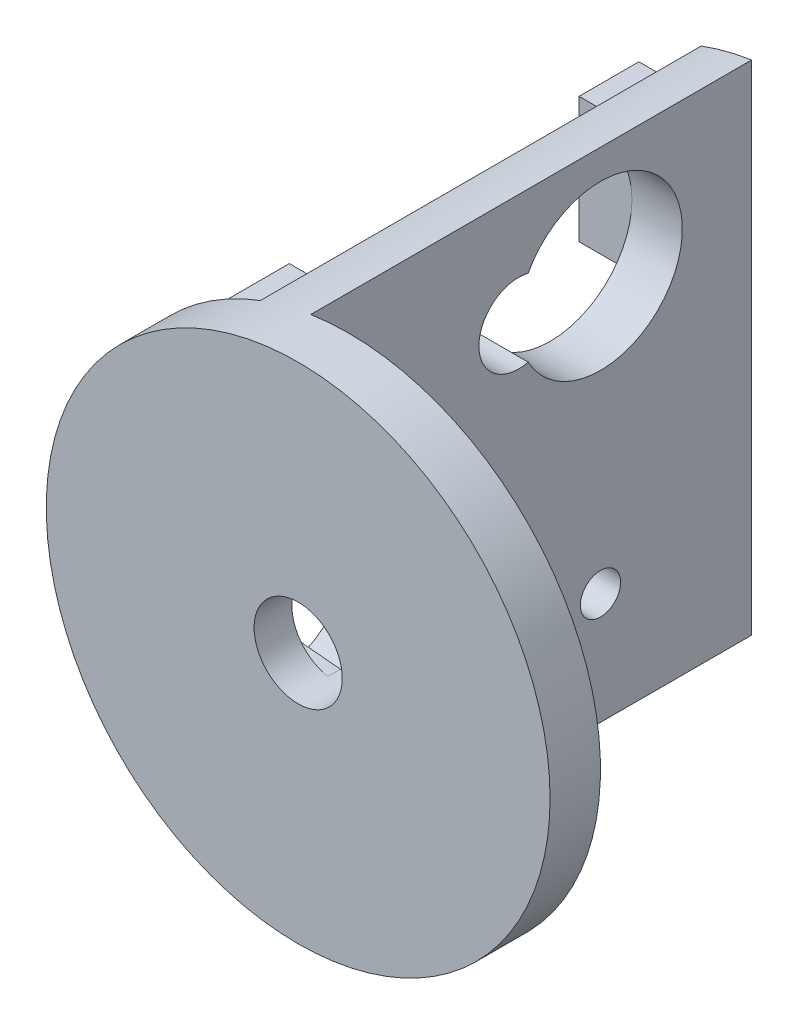
ISO-10303-21;
HEADER;
FILE_DESCRIPTION(('STEP AP214'),'2;1');
FILE_NAME('part.step','',(''),(''),'','','');
FILE_SCHEMA(('AUTOMOTIVE_DESIGN { 1 0 10303 214 1 1 1 1 }'));
ENDSEC;
DATA;
#1=APPLICATION_CONTEXT('core data for automotive mechanical design processes');
#2=APPLICATION_PROTOCOL_DEFINITION('international standard','automotive_design',2000,#1);
#3=PRODUCT_CONTEXT('',#1,'mechanical');
#4=PRODUCT('Part','Part','',(#3));
#5=PRODUCT_RELATED_PRODUCT_CATEGORY('part','',(#4));
#6=PRODUCT_DEFINITION_FORMATION('','',#4);
#7=PRODUCT_DEFINITION_CONTEXT('part definition',#1,'design');
#8=PRODUCT_DEFINITION('design','',#6,#7);
#9=PRODUCT_DEFINITION_SHAPE('','',#8);
#10=(LENGTH_UNIT() NAMED_UNIT(*) SI_UNIT(.MILLI.,.METRE.));
#11=(NAMED_UNIT(*) PLANE_ANGLE_UNIT() SI_UNIT($,.RADIAN.));
#12=(NAMED_UNIT(*) SI_UNIT($,.STERADIAN.) SOLID_ANGLE_UNIT());
#13=UNCERTAINTY_MEASURE_WITH_UNIT(LENGTH_MEASURE(1.E-05),#10,'distance_accuracy_value','');
#14=(GEOMETRIC_REPRESENTATION_CONTEXT(3) GLOBAL_UNCERTAINTY_ASSIGNED_CONTEXT((#13)) GLOBAL_UNIT_ASSIGNED_CONTEXT((#10,
#11,#12)) REPRESENTATION_CONTEXT('',''));
#15=CARTESIAN_POINT('',(0.,0.,0.));
#16=DIRECTION('',(0.,0.,1.));
#17=DIRECTION('',(1.,0.,0.));
#18=AXIS2_PLACEMENT_3D('',#15,#16,#17);
#19=CARTESIAN_POINT('',(0.,0.,0.));
#20=DIRECTION('',(0.,0.,1.));
#21=DIRECTION('',(1.,0.,0.));
#22=AXIS2_PLACEMENT_3D('',#19,#20,#21);
#23=PLANE('',#22);
#24=CARTESIAN_POINT('',(16.,0.,0.));
#25=DIRECTION('',(0.,0.,1.));
#26=DIRECTION('',(1.,0.,0.));
#27=AXIS2_PLACEMENT_3D('',#24,#25,#26);
#28=CIRCLE('',#27,2.);
#29=CARTESIAN_POINT('',(16.,-1.99999999999999,0.));
#30=VERTEX_POINT('',#29);
#31=CARTESIAN_POINT('',(16.,2.,0.));
#32=VERTEX_POINT('',#31);
#33=EDGE_CURVE('E416',#30,#32,#28,.T.);
#34=ORIENTED_EDGE('',*,*,#33,.T.);
#35=DIRECTION('',(0.995634226059288,-0.0933407086930581,0.));
#36=VECTOR('',#35,1.);
#37=CARTESIAN_POINT('',(0.325266214908034,3.46950629235237,0.));
#38=LINE('',#37,#36);
#39=CARTESIAN_POINT('',(0.650532429816068,3.43901258470474,0.));
#40=VERTEX_POINT('',#39);
#41=EDGE_CURVE('E414',#40,#32,#38,.T.);
#42=ORIENTED_EDGE('',*,*,#41,.F.);
#43=CARTESIAN_POINT('',(0.,0.,0.));
#44=DIRECTION('',(0.,0.,1.));
#45=DIRECTION('',(1.,0.,0.));
#46=AXIS2_PLACEMENT_3D('',#43,#44,#45);
#47=CIRCLE('',#46,3.5);
#48=CARTESIAN_POINT('',(-0.650532429816081,3.43901258470474,0.));
#49=VERTEX_POINT('',#48);
#50=EDGE_CURVE('E411',#40,#49,#47,.T.);
#51=ORIENTED_EDGE('',*,*,#50,.T.);
#52=DIRECTION('',(0.995634226059288,0.0933407086930584,0.));
#53=VECTOR('',#52,1.);
#54=CARTESIAN_POINT('',(-0.325266214908035,3.46950629235237,0.));
#55=LINE('',#54,#53);
#56=CARTESIAN_POINT('',(-16.,2.,0.));
#57=VERTEX_POINT('',#56);
#58=EDGE_CURVE('E409',#57,#49,#55,.T.);
#59=ORIENTED_EDGE('',*,*,#58,.F.);
#60=CARTESIAN_POINT('',(-16.,0.,0.));
#61=DIRECTION('',(0.,0.,1.));
#62=DIRECTION('',(1.,0.,0.));
#63=AXIS2_PLACEMENT_3D('',#60,#61,#62);
#64=CIRCLE('',#63,2.);
#65=CARTESIAN_POINT('',(-16.,-2.,0.));
#66=VERTEX_POINT('',#65);
#67=EDGE_CURVE('E406',#57,#66,#64,.T.);
#68=ORIENTED_EDGE('',*,*,#67,.T.);
#69=DIRECTION('',(0.995634226059288,-0.0933407086930582,0.));
#70=VECTOR('',#69,1.);
#71=CARTESIAN_POINT('',(-0.325266214908034,-3.46950629235237,0.));
#72=LINE('',#71,#70);
#73=CARTESIAN_POINT('',(-0.650532429816073,-3.43901258470474,0.));
#74=VERTEX_POINT('',#73);
#75=EDGE_CURVE('E404',#66,#74,#72,.T.);
#76=ORIENTED_EDGE('',*,*,#75,.T.);
#77=CARTESIAN_POINT('',(0.,0.,0.));
#78=DIRECTION('',(0.,0.,1.));
#79=DIRECTION('',(1.,0.,0.));
#80=AXIS2_PLACEMENT_3D('',#77,#78,#79);
#81=CIRCLE('',#80,3.5);
#82=CARTESIAN_POINT('',(0.650532429816078,-3.43901258470474,0.));
#83=VERTEX_POINT('',#82);
#84=EDGE_CURVE('E397',#74,#83,#81,.T.);
#85=ORIENTED_EDGE('',*,*,#84,.T.);
#86=DIRECTION('',(0.995634226059288,0.0933407086930588,0.));
#87=VECTOR('',#86,1.);
#88=CARTESIAN_POINT('',(0.325266214908037,-3.46950629235237,0.));
#89=LINE('',#88,#87);
#90=EDGE_CURVE('E366',#83,#30,#89,.T.);
#91=ORIENTED_EDGE('',*,*,#90,.T.);
#92=EDGE_LOOP('',(#34,#42,#51,#59,#68,#76,#85,#91));
#93=FACE_BOUND('',#92,.T.);
#94=DIRECTION('',(1.,0.,0.));
#95=VECTOR('',#94,1.);
#96=CARTESIAN_POINT('',(-11.2,15.925,0.));
#97=LINE('',#96,#95);
#98=CARTESIAN_POINT('',(-11.2,15.925,0.));
#99=VERTEX_POINT('',#98);
#100=CARTESIAN_POINT('',(-7.,15.925,0.));
#101=VERTEX_POINT('',#100);
#102=EDGE_CURVE('E246',#99,#101,#97,.T.);
#103=ORIENTED_EDGE('',*,*,#102,.F.);
#104=DIRECTION('',(0.,1.,0.));
#105=VECTOR('',#104,1.);
#106=CARTESIAN_POINT('',(-11.2,15.925,0.));
#107=LINE('',#106,#105);
#108=CARTESIAN_POINT('',(-11.2,5.92500000000001,0.));
#109=VERTEX_POINT('',#108);
#110=EDGE_CURVE('E244',#109,#99,#107,.T.);
#111=ORIENTED_EDGE('',*,*,#110,.F.);
#112=DIRECTION('',(1.,0.,0.));
#113=VECTOR('',#112,1.);
#114=CARTESIAN_POINT('',(-11.2,5.92500000000001,0.));
#115=LINE('',#114,#113);
#116=CARTESIAN_POINT('',(-7.,5.925,0.));
#117=VERTEX_POINT('',#116);
#118=EDGE_CURVE('E256',#109,#117,#115,.T.);
#119=ORIENTED_EDGE('',*,*,#118,.T.);
#120=DIRECTION('',(0.,1.,0.));
#121=VECTOR('',#120,1.);
#122=CARTESIAN_POINT('',(-7.,15.925,0.));
#123=LINE('',#122,#121);
#124=CARTESIAN_POINT('',(-7.,8.,0.));
#125=VERTEX_POINT('',#124);
#126=EDGE_CURVE('E240',#117,#125,#123,.T.);
#127=ORIENTED_EDGE('',*,*,#126,.T.);
#128=DIRECTION('',(-1.,0.,0.));
#129=VECTOR('',#128,1.);
#130=CARTESIAN_POINT('',(0.999999999999997,8.,0.));
#131=LINE('',#130,#129);
#132=CARTESIAN_POINT('',(-2.99999999999999,8.,0.));
#133=VERTEX_POINT('',#132);
#134=EDGE_CURVE('E268',#133,#125,#131,.T.);
#135=ORIENTED_EDGE('',*,*,#134,.F.);
#136=DIRECTION('',(0.,1.,0.));
#137=VECTOR('',#136,1.);
#138=CARTESIAN_POINT('',(-2.99999999999999,0.,0.));
#139=LINE('',#138,#137);
#140=CARTESIAN_POINT('',(-2.99999999999999,19.7737199332852,0.));
#141=VERTEX_POINT('',#140);
#142=EDGE_CURVE('E333',#133,#141,#139,.T.);
#143=ORIENTED_EDGE('',*,*,#142,.T.);
#144=CARTESIAN_POINT('',(0.,0.,0.));
#145=DIRECTION('',(0.,0.,1.));
#146=DIRECTION('',(1.,0.,0.));
#147=AXIS2_PLACEMENT_3D('',#144,#145,#146);
#148=CIRCLE('',#147,20.);
#149=CARTESIAN_POINT('',(-3.,-19.7737199332852,0.));
#150=VERTEX_POINT('',#149);
#151=EDGE_CURVE('E361',#150,#141,#148,.T.);
#152=ORIENTED_EDGE('',*,*,#151,.F.);
#153=CARTESIAN_POINT('',(-2.99999999999999,-8.,0.));
#154=VERTEX_POINT('',#153);
#155=EDGE_CURVE('E300',#150,#154,#139,.T.);
#156=ORIENTED_EDGE('',*,*,#155,.T.);
#157=DIRECTION('',(-1.,0.,0.));
#158=VECTOR('',#157,1.);
#159=CARTESIAN_POINT('',(0.999999999999993,-8.,0.));
#160=LINE('',#159,#158);
#161=CARTESIAN_POINT('',(-7.00000000000001,-8.,0.));
#162=VERTEX_POINT('',#161);
#163=EDGE_CURVE('E267',#154,#162,#160,.T.);
#164=ORIENTED_EDGE('',*,*,#163,.T.);
#165=DIRECTION('',(0.,-1.,0.));
#166=VECTOR('',#165,1.);
#167=CARTESIAN_POINT('',(-7.00000000000001,0.,0.));
#168=LINE('',#167,#166);
#169=CARTESIAN_POINT('',(-7.00000000000001,-18.7349939951952,0.));
#170=VERTEX_POINT('',#169);
#171=EDGE_CURVE('E314',#162,#170,#168,.T.);
#172=ORIENTED_EDGE('',*,*,#171,.T.);
#173=CARTESIAN_POINT('',(-7.,18.7349939951952,0.));
#174=VERTEX_POINT('',#173);
#175=EDGE_CURVE('E345',#174,#170,#148,.T.);
#176=ORIENTED_EDGE('',*,*,#175,.F.);
#177=EDGE_CURVE('E295',#174,#101,#168,.T.);
#178=ORIENTED_EDGE('',*,*,#177,.T.);
#179=EDGE_LOOP('',(#103,#111,#119,#127,#135,#143,#152,#156,#164,#172,#176,#178));
#180=FACE_BOUND('',#179,.T.);
#181=ADVANCED_FACE('F34',(#93,#180),#23,.F.);
#182=CARTESIAN_POINT('',(-0.325266214908034,-3.46950629235237,4.));
#183=DIRECTION('',(0.0933407086930582,0.995634226059288,0.));
#184=DIRECTION('',(-0.995634226059288,0.0933407086930581,0.));
#185=AXIS2_PLACEMENT_3D('',#182,#183,#184);
#186=PLANE('',#185);
#187=DIRECTION('',(0.,0.,-1.));
#188=VECTOR('',#187,1.);
#189=CARTESIAN_POINT('',(-16.,-2.,4.));
#190=LINE('',#189,#188);
#191=CARTESIAN_POINT('',(-16.,-2.,1.));
#192=VERTEX_POINT('',#191);
#193=EDGE_CURVE('E434',#192,#66,#190,.T.);
#194=ORIENTED_EDGE('',*,*,#193,.F.);
#195=DIRECTION('',(0.995634226059288,-0.0933407086930581,0.));
#196=VECTOR('',#195,1.);
#197=CARTESIAN_POINT('',(-0.325266214908034,-3.46950629235237,1.));
#198=LINE('',#197,#196);
#199=CARTESIAN_POINT('',(-0.650532429816058,-3.43901258470475,1.));
#200=VERTEX_POINT('',#199);
#201=EDGE_CURVE('E395',#192,#200,#198,.T.);
#202=ORIENTED_EDGE('',*,*,#201,.T.);
#203=DIRECTION('',(0.,0.,-1.));
#204=VECTOR('',#203,1.);
#205=CARTESIAN_POINT('',(-0.650532429816073,-3.43901258470474,4.));
#206=LINE('',#205,#204);
#207=EDGE_CURVE('E334',#200,#74,#206,.T.);
#208=ORIENTED_EDGE('',*,*,#207,.T.);
#209=ORIENTED_EDGE('',*,*,#75,.F.);
#210=EDGE_LOOP('',(#194,#202,#208,#209));
#211=FACE_BOUND('',#210,.T.);
#212=ADVANCED_FACE('F36',(#211),#186,.T.);
#213=CARTESIAN_POINT('',(-16.,0.,4.));
#214=DIRECTION('',(0.,0.,-1.));
#215=DIRECTION('',(-1.,0.,0.));
#216=AXIS2_PLACEMENT_3D('',#213,#214,#215);
#217=CYLINDRICAL_SURFACE('',#216,2.);
#218=DIRECTION('',(0.,0.,-1.));
#219=VECTOR('',#218,1.);
#220=CARTESIAN_POINT('',(-16.,2.,4.));
#221=LINE('',#220,#219);
#222=CARTESIAN_POINT('',(-16.,2.,1.));
#223=VERTEX_POINT('',#222);
#224=EDGE_CURVE('E432',#223,#57,#221,.T.);
#225=ORIENTED_EDGE('',*,*,#224,.F.);
#226=CARTESIAN_POINT('',(-16.,0.,1.));
#227=DIRECTION('',(0.,0.,1.));
#228=DIRECTION('',(1.,0.,0.));
#229=AXIS2_PLACEMENT_3D('',#226,#227,#228);
#230=CIRCLE('',#229,2.);
#231=EDGE_CURVE('E392',#223,#192,#230,.T.);
#232=ORIENTED_EDGE('',*,*,#231,.T.);
#233=ORIENTED_EDGE('',*,*,#193,.T.);
#234=ORIENTED_EDGE('',*,*,#67,.F.);
#235=EDGE_LOOP('',(#225,#232,#233,#234));
#236=FACE_BOUND('',#235,.T.);
#237=ADVANCED_FACE('F466',(#236),#217,.F.);
#238=CARTESIAN_POINT('',(-0.325266214908035,3.46950629235237,4.));
#239=DIRECTION('',(-0.0933407086930584,0.995634226059288,0.));
#240=DIRECTION('',(-0.995634226059288,-0.0933407086930584,0.));
#241=AXIS2_PLACEMENT_3D('',#238,#239,#240);
#242=PLANE('',#241);
#243=DIRECTION('',(0.995634226059288,0.0933407086930584,0.));
#244=VECTOR('',#243,1.);
#245=CARTESIAN_POINT('',(-0.325266214908035,3.46950629235237,1.));
#246=LINE('',#245,#244);
#247=CARTESIAN_POINT('',(-0.650532429816081,3.43901258470474,1.));
#248=VERTEX_POINT('',#247);
#249=EDGE_CURVE('E389',#223,#248,#246,.T.);
#250=ORIENTED_EDGE('',*,*,#249,.F.);
#251=ORIENTED_EDGE('',*,*,#224,.T.);
#252=ORIENTED_EDGE('',*,*,#58,.T.);
#253=DIRECTION('',(0.,0.,-1.));
#254=VECTOR('',#253,1.);
#255=CARTESIAN_POINT('',(-0.650532429816081,3.43901258470474,4.));
#256=LINE('',#255,#254);
#257=EDGE_CURVE('E429',#248,#49,#256,.T.);
#258=ORIENTED_EDGE('',*,*,#257,.F.);
#259=EDGE_LOOP('',(#250,#251,#252,#258));
#260=FACE_BOUND('',#259,.T.);
#261=ADVANCED_FACE('F462',(#260),#242,.F.);
#262=CARTESIAN_POINT('',(0.325266214908034,3.46950629235237,4.));
#263=DIRECTION('',(0.0933407086930581,0.995634226059288,0.));
#264=DIRECTION('',(-0.995634226059288,0.0933407086930581,0.));
#265=AXIS2_PLACEMENT_3D('',#262,#263,#264);
#266=PLANE('',#265);
#267=DIRECTION('',(0.995634226059288,-0.0933407086930581,0.));
#268=VECTOR('',#267,1.);
#269=CARTESIAN_POINT('',(0.325266214908034,3.46950629235237,1.));
#270=LINE('',#269,#268);
#271=CARTESIAN_POINT('',(0.650532429816057,3.43901258470475,1.));
#272=VERTEX_POINT('',#271);
#273=CARTESIAN_POINT('',(16.,2.,1.));
#274=VERTEX_POINT('',#273);
#275=EDGE_CURVE('E387',#272,#274,#270,.T.);
#276=ORIENTED_EDGE('',*,*,#275,.F.);
#277=DIRECTION('',(0.,0.,-1.));
#278=VECTOR('',#277,1.);
#279=CARTESIAN_POINT('',(0.650532429816068,3.43901258470474,4.));
#280=LINE('',#279,#278);
#281=EDGE_CURVE('E427',#272,#40,#280,.T.);
#282=ORIENTED_EDGE('',*,*,#281,.T.);
#283=ORIENTED_EDGE('',*,*,#41,.T.);
#284=DIRECTION('',(0.,0.,-1.));
#285=VECTOR('',#284,1.);
#286=CARTESIAN_POINT('',(16.,2.,4.));
#287=LINE('',#286,#285);
#288=EDGE_CURVE('E424',#274,#32,#287,.T.);
#289=ORIENTED_EDGE('',*,*,#288,.F.);
#290=EDGE_LOOP('',(#276,#282,#283,#289));
#291=FACE_BOUND('',#290,.T.);
#292=ADVANCED_FACE('F495',(#291),#266,.F.);
#293=CARTESIAN_POINT('',(16.,0.,4.));
#294=DIRECTION('',(0.,0.,-1.));
#295=DIRECTION('',(-1.,0.,0.));
#296=AXIS2_PLACEMENT_3D('',#293,#294,#295);
#297=CYLINDRICAL_SURFACE('',#296,2.);
#298=DIRECTION('',(0.,0.,-1.));
#299=VECTOR('',#298,1.);
#300=CARTESIAN_POINT('',(16.,-1.99999999999999,4.));
#301=LINE('',#300,#299);
#302=CARTESIAN_POINT('',(16.,-1.99999999999999,1.));
#303=VERTEX_POINT('',#302);
#304=EDGE_CURVE('E421',#303,#30,#301,.T.);
#305=ORIENTED_EDGE('',*,*,#304,.F.);
#306=CARTESIAN_POINT('',(16.,0.,1.));
#307=DIRECTION('',(0.,0.,1.));
#308=DIRECTION('',(1.,0.,0.));
#309=AXIS2_PLACEMENT_3D('',#306,#307,#308);
#310=CIRCLE('',#309,2.);
#311=EDGE_CURVE('E384',#303,#274,#310,.T.);
#312=ORIENTED_EDGE('',*,*,#311,.T.);
#313=ORIENTED_EDGE('',*,*,#288,.T.);
#314=ORIENTED_EDGE('',*,*,#33,.F.);
#315=EDGE_LOOP('',(#305,#312,#313,#314));
#316=FACE_BOUND('',#315,.T.);
#317=ADVANCED_FACE('F452',(#316),#297,.F.);
#318=CARTESIAN_POINT('',(0.325266214908037,-3.46950629235237,4.));
#319=DIRECTION('',(-0.0933407086930588,0.995634226059288,0.));
#320=DIRECTION('',(-0.995634226059288,-0.0933407086930588,0.));
#321=AXIS2_PLACEMENT_3D('',#318,#319,#320);
#322=PLANE('',#321);
#323=DIRECTION('',(0.,0.,-1.));
#324=VECTOR('',#323,1.);
#325=CARTESIAN_POINT('',(0.650532429816078,-3.43901258470474,4.));
#326=LINE('',#325,#324);
#327=CARTESIAN_POINT('',(0.650532429816078,-3.43901258470474,1.));
#328=VERTEX_POINT('',#327);
#329=EDGE_CURVE('E401',#328,#83,#326,.T.);
#330=ORIENTED_EDGE('',*,*,#329,.F.);
#331=DIRECTION('',(0.995634226059288,0.0933407086930588,0.));
#332=VECTOR('',#331,1.);
#333=CARTESIAN_POINT('',(0.325266214908037,-3.46950629235237,1.));
#334=LINE('',#333,#332);
#335=EDGE_CURVE('E380',#328,#303,#334,.T.);
#336=ORIENTED_EDGE('',*,*,#335,.T.);
#337=ORIENTED_EDGE('',*,*,#304,.T.);
#338=ORIENTED_EDGE('',*,*,#90,.F.);
#339=EDGE_LOOP('',(#330,#336,#337,#338));
#340=FACE_BOUND('',#339,.T.);
#341=ADVANCED_FACE('F448',(#340),#322,.T.);
#342=CARTESIAN_POINT('',(0.,0.,4.));
#343=DIRECTION('',(0.,0.,-1.));
#344=DIRECTION('',(-1.,0.,0.));
#345=AXIS2_PLACEMENT_3D('',#342,#343,#344);
#346=CYLINDRICAL_SURFACE('',#345,3.5);
#347=CARTESIAN_POINT('',(0.,0.,1.));
#348=DIRECTION('',(0.,0.,1.));
#349=DIRECTION('',(1.,0.,0.));
#350=AXIS2_PLACEMENT_3D('',#347,#348,#349);
#351=CIRCLE('',#350,3.5);
#352=EDGE_CURVE('E375',#328,#272,#351,.T.);
#353=ORIENTED_EDGE('',*,*,#352,.F.);
#354=ORIENTED_EDGE('',*,*,#329,.T.);
#355=ORIENTED_EDGE('',*,*,#84,.F.);
#356=ORIENTED_EDGE('',*,*,#207,.F.);
#357=EDGE_CURVE('E376',#248,#200,#351,.T.);
#358=ORIENTED_EDGE('',*,*,#357,.F.);
#359=ORIENTED_EDGE('',*,*,#257,.T.);
#360=ORIENTED_EDGE('',*,*,#50,.F.);
#361=ORIENTED_EDGE('',*,*,#281,.F.);
#362=EDGE_LOOP('',(#353,#354,#355,#356,#358,#359,#360,#361));
#363=FACE_BOUND('',#362,.T.);
#364=CARTESIAN_POINT('',(0.,0.,4.));
#365=DIRECTION('',(0.,0.,1.));
#366=DIRECTION('',(1.,0.,0.));
#367=AXIS2_PLACEMENT_3D('',#364,#365,#366);
#368=CIRCLE('',#367,3.5);
#369=CARTESIAN_POINT('',(3.5,0.,4.));
#370=VERTEX_POINT('',#369);
#371=EDGE_CURVE('E360',#370,#370,#368,.T.);
#372=ORIENTED_EDGE('',*,*,#371,.T.);
#373=EDGE_LOOP('',(#372));
#374=FACE_BOUND('',#373,.T.);
#375=ADVANCED_FACE('F442',(#363,#374),#346,.F.);
#376=CARTESIAN_POINT('',(0.,0.,4.));
#377=DIRECTION('',(0.,0.,-1.));
#378=DIRECTION('',(-1.,0.,0.));
#379=AXIS2_PLACEMENT_3D('',#376,#377,#378);
#380=CYLINDRICAL_SURFACE('',#379,20.);
#381=CARTESIAN_POINT('',(0.,0.,4.));
#382=DIRECTION('',(0.,0.,1.));
#383=DIRECTION('',(1.,0.,0.));
#384=AXIS2_PLACEMENT_3D('',#381,#382,#383);
#385=CIRCLE('',#384,20.);
#386=CARTESIAN_POINT('',(20.,0.,4.));
#387=VERTEX_POINT('',#386);
#388=EDGE_CURVE('E364',#387,#387,#385,.T.);
#389=ORIENTED_EDGE('',*,*,#388,.F.);
#390=EDGE_LOOP('',(#389));
#391=FACE_BOUND('',#390,.T.);
#392=ORIENTED_EDGE('',*,*,#151,.T.);
#393=DIRECTION('',(0.,0.,1.));
#394=VECTOR('',#393,1.);
#395=CARTESIAN_POINT('',(-2.99999999999999,19.7737199332852,-35.));
#396=LINE('',#395,#394);
#397=CARTESIAN_POINT('',(-2.99999999999999,19.7737199332852,-35.));
#398=VERTEX_POINT('',#397);
#399=EDGE_CURVE('E324',#398,#141,#396,.T.);
#400=ORIENTED_EDGE('',*,*,#399,.F.);
#401=CARTESIAN_POINT('',(0.,0.,-35.));
#402=DIRECTION('',(0.,0.,-1.));
#403=DIRECTION('',(-1.,0.,0.));
#404=AXIS2_PLACEMENT_3D('',#401,#402,#403);
#405=CIRCLE('',#404,20.);
#406=CARTESIAN_POINT('',(-7.,18.7349939951952,-35.));
#407=VERTEX_POINT('',#406);
#408=EDGE_CURVE('E299',#407,#398,#405,.T.);
#409=ORIENTED_EDGE('',*,*,#408,.F.);
#410=DIRECTION('',(0.,0.,1.));
#411=VECTOR('',#410,1.);
#412=CARTESIAN_POINT('',(-7.,18.7349939951952,-35.));
#413=LINE('',#412,#411);
#414=EDGE_CURVE('E358',#407,#174,#413,.T.);
#415=ORIENTED_EDGE('',*,*,#414,.T.);
#416=ORIENTED_EDGE('',*,*,#175,.T.);
#417=DIRECTION('',(0.,0.,1.));
#418=VECTOR('',#417,1.);
#419=CARTESIAN_POINT('',(-7.00000000000001,-18.7349939951952,-35.));
#420=LINE('',#419,#418);
#421=CARTESIAN_POINT('',(-7.00000000000001,-18.7349939951952,-35.));
#422=VERTEX_POINT('',#421);
#423=EDGE_CURVE('E307',#422,#170,#420,.T.);
#424=ORIENTED_EDGE('',*,*,#423,.F.);
#425=CARTESIAN_POINT('',(0.,0.,-35.));
#426=DIRECTION('',(0.,0.,-1.));
#427=DIRECTION('',(-1.,0.,0.));
#428=AXIS2_PLACEMENT_3D('',#425,#426,#427);
#429=CIRCLE('',#428,20.);
#430=CARTESIAN_POINT('',(-3.,-19.7737199332852,-35.));
#431=VERTEX_POINT('',#430);
#432=EDGE_CURVE('E305',#431,#422,#429,.T.);
#433=ORIENTED_EDGE('',*,*,#432,.F.);
#434=DIRECTION('',(0.,0.,1.));
#435=VECTOR('',#434,1.);
#436=CARTESIAN_POINT('',(-3.,-19.7737199332852,-35.));
#437=LINE('',#436,#435);
#438=EDGE_CURVE('E322',#431,#150,#437,.T.);
#439=ORIENTED_EDGE('',*,*,#438,.T.);
#440=EDGE_LOOP('',(#392,#400,#409,#415,#416,#424,#433,#439));
#441=FACE_BOUND('',#440,.T.);
#442=ADVANCED_FACE('F356',(#391,#441),#380,.T.);
#443=CARTESIAN_POINT('',(0.,0.,4.));
#444=DIRECTION('',(0.,0.,1.));
#445=DIRECTION('',(1.,0.,0.));
#446=AXIS2_PLACEMENT_3D('',#443,#444,#445);
#447=PLANE('',#446);
#448=ORIENTED_EDGE('',*,*,#371,.F.);
#449=EDGE_LOOP('',(#448));
#450=FACE_BOUND('',#449,.T.);
#451=ORIENTED_EDGE('',*,*,#388,.T.);
#452=EDGE_LOOP('',(#451));
#453=FACE_BOUND('',#452,.T.);
#454=ADVANCED_FACE('F480',(#450,#453),#447,.T.);
#455=CARTESIAN_POINT('',(0.,0.,1.));
#456=DIRECTION('',(0.,0.,1.));
#457=DIRECTION('',(1.,0.,0.));
#458=AXIS2_PLACEMENT_3D('',#455,#456,#457);
#459=PLANE('',#458);
#460=ORIENTED_EDGE('',*,*,#352,.T.);
#461=ORIENTED_EDGE('',*,*,#275,.T.);
#462=ORIENTED_EDGE('',*,*,#311,.F.);
#463=ORIENTED_EDGE('',*,*,#335,.F.);
#464=EDGE_LOOP('',(#460,#461,#462,#463));
#465=FACE_BOUND('',#464,.T.);
#466=ADVANCED_FACE('F470',(#465),#459,.F.);
#467=ORIENTED_EDGE('',*,*,#201,.F.);
#468=ORIENTED_EDGE('',*,*,#231,.F.);
#469=ORIENTED_EDGE('',*,*,#249,.T.);
#470=ORIENTED_EDGE('',*,*,#357,.T.);
#471=EDGE_LOOP('',(#467,#468,#469,#470));
#472=FACE_BOUND('',#471,.T.);
#473=ADVANCED_FACE('F468',(#472),#459,.F.);
#474=CARTESIAN_POINT('',(-7.00000000000001,0.,-35.));
#475=DIRECTION('',(-1.,0.,0.));
#476=DIRECTION('',(0.,-1.,0.));
#477=AXIS2_PLACEMENT_3D('',#474,#475,#476);
#478=PLANE('',#477);
#479=DIRECTION('',(0.,-1.,0.));
#480=VECTOR('',#479,1.);
#481=CARTESIAN_POINT('',(-7.,5.925,-6.5));
#482=LINE('',#481,#480);
#483=CARTESIAN_POINT('',(-7.,15.925,-6.5));
#484=VERTEX_POINT('',#483);
#485=CARTESIAN_POINT('',(-7.,5.925,-6.5));
#486=VERTEX_POINT('',#485);
#487=EDGE_CURVE('E249',#484,#486,#482,.T.);
#488=ORIENTED_EDGE('',*,*,#487,.F.);
#489=DIRECTION('',(0.,0.,-1.));
#490=VECTOR('',#489,1.);
#491=CARTESIAN_POINT('',(-7.,15.925,0.));
#492=LINE('',#491,#490);
#493=EDGE_CURVE('E231',#101,#484,#492,.T.);
#494=ORIENTED_EDGE('',*,*,#493,.F.);
#495=ORIENTED_EDGE('',*,*,#177,.F.);
#496=ORIENTED_EDGE('',*,*,#414,.F.);
#497=DIRECTION('',(0.,-1.,0.));
#498=VECTOR('',#497,1.);
#499=CARTESIAN_POINT('',(-7.00000000000001,0.,-35.));
#500=LINE('',#499,#498);
#501=EDGE_CURVE('E296',#407,#422,#500,.T.);
#502=ORIENTED_EDGE('',*,*,#501,.T.);
#503=ORIENTED_EDGE('',*,*,#423,.T.);
#504=ORIENTED_EDGE('',*,*,#171,.F.);
#505=CARTESIAN_POINT('',(-7.00000000000001,0.,0.));
#506=DIRECTION('',(-1.,0.,0.));
#507=DIRECTION('',(0.,-1.,0.));
#508=AXIS2_PLACEMENT_3D('',#505,#506,#507);
#509=CIRCLE('',#508,8.);
#510=CARTESIAN_POINT('',(-7.,5.925,-5.37534882589028));
#511=VERTEX_POINT('',#510);
#512=EDGE_CURVE('E263',#511,#162,#509,.T.);
#513=ORIENTED_EDGE('',*,*,#512,.F.);
#514=DIRECTION('',(0.,0.,1.));
#515=VECTOR('',#514,1.);
#516=CARTESIAN_POINT('',(-7.,5.925,0.));
#517=LINE('',#516,#515);
#518=EDGE_CURVE('E57',#486,#511,#517,.T.);
#519=ORIENTED_EDGE('',*,*,#518,.F.);
#520=EDGE_LOOP('',(#488,#494,#495,#496,#502,#503,#504,#513,#519));
#521=FACE_BOUND('',#520,.T.);
#522=CARTESIAN_POINT('',(-7.00000000000001,-10.925,-23.));
#523=DIRECTION('',(-1.,0.,0.));
#524=DIRECTION('',(0.,-1.,0.));
#525=AXIS2_PLACEMENT_3D('',#522,#523,#524);
#526=CIRCLE('',#525,1.6);
#527=CARTESIAN_POINT('',(-7.00000000000001,-12.525,-23.));
#528=VERTEX_POINT('',#527);
#529=EDGE_CURVE('E276',#528,#528,#526,.T.);
#530=ORIENTED_EDGE('',*,*,#529,.F.);
#531=EDGE_LOOP('',(#530));
#532=FACE_BOUND('',#531,.T.);
#533=DIRECTION('',(0.,0.,-1.));
#534=VECTOR('',#533,1.);
#535=CARTESIAN_POINT('',(-7.,15.925,-34.25));
#536=LINE('',#535,#534);
#537=CARTESIAN_POINT('',(-7.,15.925,-29.5));
#538=VERTEX_POINT('',#537);
#539=CARTESIAN_POINT('',(-7.,15.925,-34.25));
#540=VERTEX_POINT('',#539);
#541=EDGE_CURVE('E778',#538,#540,#536,.T.);
#542=ORIENTED_EDGE('',*,*,#541,.F.);
#543=DIRECTION('',(0.,1.,0.));
#544=VECTOR('',#543,1.);
#545=CARTESIAN_POINT('',(-7.,15.925,-29.5));
#546=LINE('',#545,#544);
#547=CARTESIAN_POINT('',(-7.,10.925,-29.5));
#548=VERTEX_POINT('',#547);
#549=EDGE_CURVE('E227',#548,#538,#546,.T.);
#550=ORIENTED_EDGE('',*,*,#549,.F.);
#551=CARTESIAN_POINT('',(-7.,10.925,-23.));
#552=DIRECTION('',(-1.,0.,0.));
#553=DIRECTION('',(0.,-1.,0.));
#554=AXIS2_PLACEMENT_3D('',#551,#552,#553);
#555=CIRCLE('',#554,6.5);
#556=CARTESIAN_POINT('',(-7.,13.9811282828705,-17.2632692307692));
#557=VERTEX_POINT('',#556);
#558=EDGE_CURVE('E292',#557,#548,#555,.T.);
#559=ORIENTED_EDGE('',*,*,#558,.F.);
#560=CARTESIAN_POINT('',(-7.,10.925,-16.5));
#561=DIRECTION('',(-1.,0.,0.));
#562=DIRECTION('',(0.,-1.,0.));
#563=AXIS2_PLACEMENT_3D('',#560,#561,#562);
#564=CIRCLE('',#563,3.15);
#565=CARTESIAN_POINT('',(-7.,7.8688717171295,-17.2632692307692));
#566=VERTEX_POINT('',#565);
#567=EDGE_CURVE('E287',#566,#557,#564,.T.);
#568=ORIENTED_EDGE('',*,*,#567,.F.);
#569=EDGE_CURVE('E291',#548,#566,#555,.T.);
#570=ORIENTED_EDGE('',*,*,#569,.F.);
#571=CARTESIAN_POINT('',(-7.,5.92499999999999,-29.5));
#572=VERTEX_POINT('',#571);
#573=EDGE_CURVE('E772',#572,#548,#546,.T.);
#574=ORIENTED_EDGE('',*,*,#573,.F.);
#575=DIRECTION('',(0.,0.,1.));
#576=VECTOR('',#575,1.);
#577=CARTESIAN_POINT('',(-7.,5.92499999999999,-34.25));
#578=LINE('',#577,#576);
#579=CARTESIAN_POINT('',(-7.,5.92499999999999,-34.25));
#580=VERTEX_POINT('',#579);
#581=EDGE_CURVE('E223',#580,#572,#578,.T.);
#582=ORIENTED_EDGE('',*,*,#581,.F.);
#583=DIRECTION('',(0.,-1.,0.));
#584=VECTOR('',#583,1.);
#585=CARTESIAN_POINT('',(-7.,15.925,-34.25));
#586=LINE('',#585,#584);
#587=EDGE_CURVE('E780',#540,#580,#586,.T.);
#588=ORIENTED_EDGE('',*,*,#587,.F.);
#589=EDGE_LOOP('',(#542,#550,#559,#568,#570,#574,#582,#588));
#590=FACE_BOUND('',#589,.T.);
#591=ADVANCED_FACE('F350',(#521,#532,#590),#478,.T.);
#592=CARTESIAN_POINT('',(-2.99999999999999,0.,-35.));
#593=DIRECTION('',(1.,0.,0.));
#594=DIRECTION('',(0.,1.,0.));
#595=AXIS2_PLACEMENT_3D('',#592,#593,#594);
#596=PLANE('',#595);
#597=CARTESIAN_POINT('',(-2.99999999999999,0.,0.));
#598=DIRECTION('',(1.,0.,0.));
#599=DIRECTION('',(0.,1.,0.));
#600=AXIS2_PLACEMENT_3D('',#597,#598,#599);
#601=CIRCLE('',#600,8.);
#602=EDGE_CURVE('E335',#154,#133,#601,.T.);
#603=ORIENTED_EDGE('',*,*,#602,.F.);
#604=ORIENTED_EDGE('',*,*,#155,.F.);
#605=ORIENTED_EDGE('',*,*,#438,.F.);
#606=DIRECTION('',(0.,1.,0.));
#607=VECTOR('',#606,1.);
#608=CARTESIAN_POINT('',(-2.99999999999999,0.,-35.));
#609=LINE('',#608,#607);
#610=EDGE_CURVE('E302',#431,#398,#609,.T.);
#611=ORIENTED_EDGE('',*,*,#610,.T.);
#612=ORIENTED_EDGE('',*,*,#399,.T.);
#613=ORIENTED_EDGE('',*,*,#142,.F.);
#614=EDGE_LOOP('',(#603,#604,#605,#611,#612,#613));
#615=FACE_BOUND('',#614,.T.);
#616=CARTESIAN_POINT('',(-3.,-10.925,-23.));
#617=DIRECTION('',(1.,0.,0.));
#618=DIRECTION('',(0.,1.,0.));
#619=AXIS2_PLACEMENT_3D('',#616,#617,#618);
#620=CIRCLE('',#619,1.6);
#621=CARTESIAN_POINT('',(-3.,-9.325,-23.));
#622=VERTEX_POINT('',#621);
#623=EDGE_CURVE('E271',#622,#622,#620,.T.);
#624=ORIENTED_EDGE('',*,*,#623,.F.);
#625=EDGE_LOOP('',(#624));
#626=FACE_BOUND('',#625,.T.);
#627=CARTESIAN_POINT('',(-2.99999999999999,10.925,-23.));
#628=DIRECTION('',(1.,0.,0.));
#629=DIRECTION('',(0.,1.,0.));
#630=AXIS2_PLACEMENT_3D('',#627,#628,#629);
#631=CIRCLE('',#630,6.5);
#632=CARTESIAN_POINT('',(-2.99999999999999,7.86887171712951,-17.2632692307692));
#633=VERTEX_POINT('',#632);
#634=CARTESIAN_POINT('',(-2.99999999999999,13.9811282828705,-17.2632692307692));
#635=VERTEX_POINT('',#634);
#636=EDGE_CURVE('E279',#633,#635,#631,.T.);
#637=ORIENTED_EDGE('',*,*,#636,.F.);
#638=CARTESIAN_POINT('',(-2.99999999999999,10.925,-16.5));
#639=DIRECTION('',(1.,0.,0.));
#640=DIRECTION('',(0.,1.,0.));
#641=AXIS2_PLACEMENT_3D('',#638,#639,#640);
#642=CIRCLE('',#641,3.15);
#643=EDGE_CURVE('E281',#635,#633,#642,.T.);
#644=ORIENTED_EDGE('',*,*,#643,.F.);
#645=EDGE_LOOP('',(#637,#644));
#646=FACE_BOUND('',#645,.T.);
#647=ADVANCED_FACE('F476',(#615,#626,#646),#596,.T.);
#648=CARTESIAN_POINT('',(0.,0.,-35.));
#649=DIRECTION('',(0.,0.,-1.));
#650=DIRECTION('',(-1.,0.,0.));
#651=AXIS2_PLACEMENT_3D('',#648,#649,#650);
#652=PLANE('',#651);
#653=ORIENTED_EDGE('',*,*,#501,.F.);
#654=ORIENTED_EDGE('',*,*,#408,.T.);
#655=ORIENTED_EDGE('',*,*,#610,.F.);
#656=ORIENTED_EDGE('',*,*,#432,.T.);
#657=EDGE_LOOP('',(#653,#654,#655,#656));
#658=FACE_BOUND('',#657,.T.);
#659=ADVANCED_FACE('F571',(#658),#652,.T.);
#660=CARTESIAN_POINT('',(-13.,10.925,-23.));
#661=DIRECTION('',(1.,0.,0.));
#662=DIRECTION('',(0.,1.,0.));
#663=AXIS2_PLACEMENT_3D('',#660,#661,#662);
#664=CYLINDRICAL_SURFACE('',#663,6.5);
#665=ORIENTED_EDGE('',*,*,#558,.T.);
#666=ORIENTED_EDGE('',*,*,#569,.T.);
#667=DIRECTION('',(1.,0.,0.));
#668=VECTOR('',#667,1.);
#669=CARTESIAN_POINT('',(-13.,7.86887171712951,-17.2632692307692));
#670=LINE('',#669,#668);
#671=EDGE_CURVE('E285',#566,#633,#670,.T.);
#672=ORIENTED_EDGE('',*,*,#671,.T.);
#673=ORIENTED_EDGE('',*,*,#636,.T.);
#674=DIRECTION('',(1.,0.,0.));
#675=VECTOR('',#674,1.);
#676=CARTESIAN_POINT('',(-13.,13.9811282828705,-17.2632692307692));
#677=LINE('',#676,#675);
#678=EDGE_CURVE('E284',#557,#635,#677,.T.);
#679=ORIENTED_EDGE('',*,*,#678,.F.);
#680=EDGE_LOOP('',(#665,#666,#672,#673,#679));
#681=FACE_BOUND('',#680,.T.);
#682=ADVANCED_FACE('F582',(#681),#664,.F.);
#683=CARTESIAN_POINT('',(-13.,10.925,-16.5));
#684=DIRECTION('',(1.,0.,0.));
#685=DIRECTION('',(0.,1.,0.));
#686=AXIS2_PLACEMENT_3D('',#683,#684,#685);
#687=CYLINDRICAL_SURFACE('',#686,3.15);
#688=ORIENTED_EDGE('',*,*,#567,.T.);
#689=ORIENTED_EDGE('',*,*,#678,.T.);
#690=ORIENTED_EDGE('',*,*,#643,.T.);
#691=ORIENTED_EDGE('',*,*,#671,.F.);
#692=EDGE_LOOP('',(#688,#689,#690,#691));
#693=FACE_BOUND('',#692,.T.);
#694=ADVANCED_FACE('F597',(#693),#687,.F.);
#695=CARTESIAN_POINT('',(-13.,-10.925,-23.));
#696=DIRECTION('',(1.,0.,0.));
#697=DIRECTION('',(0.,1.,0.));
#698=AXIS2_PLACEMENT_3D('',#695,#696,#697);
#699=CYLINDRICAL_SURFACE('',#698,1.6);
#700=ORIENTED_EDGE('',*,*,#529,.T.);
#701=EDGE_LOOP('',(#700));
#702=FACE_BOUND('',#701,.T.);
#703=ORIENTED_EDGE('',*,*,#623,.T.);
#704=EDGE_LOOP('',(#703));
#705=FACE_BOUND('',#704,.T.);
#706=ADVANCED_FACE('F606',(#702,#705),#699,.F.);
#707=CARTESIAN_POINT('',(0.999999999999995,0.,0.));
#708=DIRECTION('',(-1.,0.,0.));
#709=DIRECTION('',(0.,-1.,0.));
#710=AXIS2_PLACEMENT_3D('',#707,#708,#709);
#711=CYLINDRICAL_SURFACE('',#710,8.);
#712=ORIENTED_EDGE('',*,*,#602,.T.);
#713=ORIENTED_EDGE('',*,*,#134,.T.);
#714=EDGE_CURVE('E264',#125,#511,#509,.T.);
#715=ORIENTED_EDGE('',*,*,#714,.T.);
#716=ORIENTED_EDGE('',*,*,#512,.T.);
#717=ORIENTED_EDGE('',*,*,#163,.F.);
#718=EDGE_LOOP('',(#712,#713,#715,#716,#717));
#719=FACE_BOUND('',#718,.T.);
#720=ADVANCED_FACE('F615',(#719),#711,.F.);
#721=CARTESIAN_POINT('',(-7.00000000000001,0.,0.));
#722=DIRECTION('',(1.,0.,0.));
#723=DIRECTION('',(0.,1.,0.));
#724=AXIS2_PLACEMENT_3D('',#721,#722,#723);
#725=PLANE('',#724);
#726=ORIENTED_EDGE('',*,*,#714,.F.);
#727=ORIENTED_EDGE('',*,*,#126,.F.);
#728=EDGE_CURVE('E251',#511,#117,#517,.T.);
#729=ORIENTED_EDGE('',*,*,#728,.F.);
#730=EDGE_LOOP('',(#726,#727,#729));
#731=FACE_BOUND('',#730,.T.);
#732=ADVANCED_FACE('F623',(#731),#725,.T.);
#733=CARTESIAN_POINT('',(-11.2,0.,0.));
#734=DIRECTION('',(1.,0.,0.));
#735=DIRECTION('',(0.,1.,0.));
#736=AXIS2_PLACEMENT_3D('',#733,#734,#735);
#737=PLANE('',#736);
#738=DIRECTION('',(0.,0.,-1.));
#739=VECTOR('',#738,1.);
#740=CARTESIAN_POINT('',(-11.2,15.925,0.));
#741=LINE('',#740,#739);
#742=CARTESIAN_POINT('',(-11.2,15.925,-6.5));
#743=VERTEX_POINT('',#742);
#744=EDGE_CURVE('E236',#99,#743,#741,.T.);
#745=ORIENTED_EDGE('',*,*,#744,.T.);
#746=DIRECTION('',(0.,-1.,0.));
#747=VECTOR('',#746,1.);
#748=CARTESIAN_POINT('',(-11.2,5.925,-6.5));
#749=LINE('',#748,#747);
#750=CARTESIAN_POINT('',(-11.2,5.925,-6.5));
#751=VERTEX_POINT('',#750);
#752=EDGE_CURVE('E239',#743,#751,#749,.T.);
#753=ORIENTED_EDGE('',*,*,#752,.T.);
#754=DIRECTION('',(0.,0.,1.));
#755=VECTOR('',#754,1.);
#756=CARTESIAN_POINT('',(-11.2,5.92500000000001,0.));
#757=LINE('',#756,#755);
#758=EDGE_CURVE('E242',#751,#109,#757,.T.);
#759=ORIENTED_EDGE('',*,*,#758,.T.);
#760=ORIENTED_EDGE('',*,*,#110,.T.);
#761=EDGE_LOOP('',(#745,#753,#759,#760));
#762=FACE_BOUND('',#761,.T.);
#763=CARTESIAN_POINT('',(-11.2,10.925,-4.25));
#764=DIRECTION('',(-1.,0.,0.));
#765=DIRECTION('',(0.,-1.,0.));
#766=AXIS2_PLACEMENT_3D('',#763,#764,#765);
#767=CIRCLE('',#766,0.75);
#768=CARTESIAN_POINT('',(-11.2,10.175,-4.25));
#769=VERTEX_POINT('',#768);
#770=EDGE_CURVE('E228',#769,#769,#767,.T.);
#771=ORIENTED_EDGE('',*,*,#770,.F.);
#772=EDGE_LOOP('',(#771));
#773=FACE_BOUND('',#772,.T.);
#774=ADVANCED_FACE('F657',(#762,#773),#737,.F.);
#775=CARTESIAN_POINT('',(-11.2,15.925,0.));
#776=DIRECTION('',(0.,-1.,0.));
#777=DIRECTION('',(1.,0.,0.));
#778=AXIS2_PLACEMENT_3D('',#775,#776,#777);
#779=PLANE('',#778);
#780=ORIENTED_EDGE('',*,*,#493,.T.);
#781=DIRECTION('',(1.,0.,0.));
#782=VECTOR('',#781,1.);
#783=CARTESIAN_POINT('',(-11.2,15.925,-6.5));
#784=LINE('',#783,#782);
#785=EDGE_CURVE('E261',#743,#484,#784,.T.);
#786=ORIENTED_EDGE('',*,*,#785,.F.);
#787=ORIENTED_EDGE('',*,*,#744,.F.);
#788=ORIENTED_EDGE('',*,*,#102,.T.);
#789=EDGE_LOOP('',(#780,#786,#787,#788));
#790=FACE_BOUND('',#789,.T.);
#791=ADVANCED_FACE('F666',(#790),#779,.F.);
#792=CARTESIAN_POINT('',(-11.2,5.925,-6.5));
#793=DIRECTION('',(0.,0.,1.));
#794=DIRECTION('',(1.,0.,0.));
#795=AXIS2_PLACEMENT_3D('',#792,#793,#794);
#796=PLANE('',#795);
#797=ORIENTED_EDGE('',*,*,#487,.T.);
#798=DIRECTION('',(1.,0.,0.));
#799=VECTOR('',#798,1.);
#800=CARTESIAN_POINT('',(-11.2,5.925,-6.5));
#801=LINE('',#800,#799);
#802=EDGE_CURVE('E259',#751,#486,#801,.T.);
#803=ORIENTED_EDGE('',*,*,#802,.F.);
#804=ORIENTED_EDGE('',*,*,#752,.F.);
#805=ORIENTED_EDGE('',*,*,#785,.T.);
#806=EDGE_LOOP('',(#797,#803,#804,#805));
#807=FACE_BOUND('',#806,.T.);
#808=ADVANCED_FACE('F675',(#807),#796,.F.);
#809=CARTESIAN_POINT('',(-11.2,5.92500000000001,0.));
#810=DIRECTION('',(0.,1.,0.));
#811=DIRECTION('',(-1.,0.,0.));
#812=AXIS2_PLACEMENT_3D('',#809,#810,#811);
#813=PLANE('',#812);
#814=ORIENTED_EDGE('',*,*,#518,.T.);
#815=ORIENTED_EDGE('',*,*,#728,.T.);
#816=ORIENTED_EDGE('',*,*,#118,.F.);
#817=ORIENTED_EDGE('',*,*,#758,.F.);
#818=ORIENTED_EDGE('',*,*,#802,.T.);
#819=EDGE_LOOP('',(#814,#815,#816,#817,#818));
#820=FACE_BOUND('',#819,.T.);
#821=ADVANCED_FACE('F684',(#820),#813,.F.);
#822=CARTESIAN_POINT('',(-11.2,10.925,-4.25));
#823=DIRECTION('',(1.,0.,0.));
#824=DIRECTION('',(0.,1.,0.));
#825=AXIS2_PLACEMENT_3D('',#822,#823,#824);
#826=CYLINDRICAL_SURFACE('',#825,0.75);
#827=ORIENTED_EDGE('',*,*,#770,.T.);
#828=EDGE_LOOP('',(#827));
#829=FACE_BOUND('',#828,.T.);
#830=CARTESIAN_POINT('',(-7.,10.925,-4.25));
#831=DIRECTION('',(-1.,0.,0.));
#832=DIRECTION('',(0.,-1.,0.));
#833=AXIS2_PLACEMENT_3D('',#830,#831,#832);
#834=CIRCLE('',#833,0.75);
#835=CARTESIAN_POINT('',(-7.,10.175,-4.25));
#836=VERTEX_POINT('',#835);
#837=EDGE_CURVE('E42',#836,#836,#834,.F.);
#838=ORIENTED_EDGE('',*,*,#837,.T.);
#839=EDGE_LOOP('',(#838));
#840=FACE_BOUND('',#839,.T.);
#841=ADVANCED_FACE('F632',(#829,#840),#826,.F.);
#842=ORIENTED_EDGE('',*,*,#837,.F.);
#843=EDGE_LOOP('',(#842));
#844=FACE_BOUND('',#843,.T.);
#845=ADVANCED_FACE('F479',(#844),#478,.T.);
#846=CARTESIAN_POINT('',(-11.2,0.,0.));
#847=DIRECTION('',(-1.,0.,0.));
#848=DIRECTION('',(0.,-1.,0.));
#849=AXIS2_PLACEMENT_3D('',#846,#847,#848);
#850=PLANE('',#849);
#851=DIRECTION('',(0.,1.,0.));
#852=VECTOR('',#851,1.);
#853=CARTESIAN_POINT('',(-11.2,15.925,-29.5));
#854=LINE('',#853,#852);
#855=CARTESIAN_POINT('',(-11.2,5.92499999999999,-29.5));
#856=VERTEX_POINT('',#855);
#857=CARTESIAN_POINT('',(-11.2,15.925,-29.5));
#858=VERTEX_POINT('',#857);
#859=EDGE_CURVE('E214',#856,#858,#854,.T.);
#860=ORIENTED_EDGE('',*,*,#859,.T.);
#861=DIRECTION('',(0.,0.,-1.));
#862=VECTOR('',#861,1.);
#863=CARTESIAN_POINT('',(-11.2,15.925,-34.25));
#864=LINE('',#863,#862);
#865=CARTESIAN_POINT('',(-11.2,15.925,-34.25));
#866=VERTEX_POINT('',#865);
#867=EDGE_CURVE('E203',#858,#866,#864,.T.);
#868=ORIENTED_EDGE('',*,*,#867,.T.);
#869=DIRECTION('',(0.,-1.,0.));
#870=VECTOR('',#869,1.);
#871=CARTESIAN_POINT('',(-11.2,15.925,-34.25));
#872=LINE('',#871,#870);
#873=CARTESIAN_POINT('',(-11.2,5.92499999999999,-34.25));
#874=VERTEX_POINT('',#873);
#875=EDGE_CURVE('E213',#866,#874,#872,.T.);
#876=ORIENTED_EDGE('',*,*,#875,.T.);
#877=DIRECTION('',(0.,0.,1.));
#878=VECTOR('',#877,1.);
#879=CARTESIAN_POINT('',(-11.2,5.92499999999999,-34.25));
#880=LINE('',#879,#878);
#881=EDGE_CURVE('E219',#874,#856,#880,.T.);
#882=ORIENTED_EDGE('',*,*,#881,.T.);
#883=EDGE_LOOP('',(#860,#868,#876,#882));
#884=FACE_BOUND('',#883,.T.);
#885=CARTESIAN_POINT('',(-11.2,10.925,-31.875));
#886=DIRECTION('',(-1.,0.,0.));
#887=DIRECTION('',(0.,-1.,0.));
#888=AXIS2_PLACEMENT_3D('',#885,#886,#887);
#889=CIRCLE('',#888,0.750000000000002);
#890=CARTESIAN_POINT('',(-11.2,10.175,-31.875));
#891=VERTEX_POINT('',#890);
#892=EDGE_CURVE('E769',#891,#891,#889,.T.);
#893=ORIENTED_EDGE('',*,*,#892,.F.);
#894=EDGE_LOOP('',(#893));
#895=FACE_BOUND('',#894,.T.);
#896=ADVANCED_FACE('F217',(#884,#895),#850,.T.);
#897=CARTESIAN_POINT('',(-11.2,15.925,-29.5));
#898=DIRECTION('',(0.,0.,-1.));
#899=DIRECTION('',(0.,1.,0.));
#900=AXIS2_PLACEMENT_3D('',#897,#898,#899);
#901=PLANE('',#900);
#902=ORIENTED_EDGE('',*,*,#573,.T.);
#903=ORIENTED_EDGE('',*,*,#549,.T.);
#904=DIRECTION('',(1.,0.,0.));
#905=VECTOR('',#904,1.);
#906=CARTESIAN_POINT('',(-11.2,15.925,-29.5));
#907=LINE('',#906,#905);
#908=EDGE_CURVE('E207',#858,#538,#907,.T.);
#909=ORIENTED_EDGE('',*,*,#908,.F.);
#910=ORIENTED_EDGE('',*,*,#859,.F.);
#911=DIRECTION('',(1.,0.,0.));
#912=VECTOR('',#911,1.);
#913=CARTESIAN_POINT('',(-11.2,5.92499999999999,-29.5));
#914=LINE('',#913,#912);
#915=EDGE_CURVE('E776',#856,#572,#914,.T.);
#916=ORIENTED_EDGE('',*,*,#915,.T.);
#917=EDGE_LOOP('',(#902,#903,#909,#910,#916));
#918=FACE_BOUND('',#917,.T.);
#919=ADVANCED_FACE('F225',(#918),#901,.F.);
#920=CARTESIAN_POINT('',(-11.2,15.925,-34.25));
#921=DIRECTION('',(0.,-1.,0.));
#922=DIRECTION('',(1.,0.,0.));
#923=AXIS2_PLACEMENT_3D('',#920,#921,#922);
#924=PLANE('',#923);
#925=ORIENTED_EDGE('',*,*,#541,.T.);
#926=DIRECTION('',(1.,0.,0.));
#927=VECTOR('',#926,1.);
#928=CARTESIAN_POINT('',(-11.2,15.925,-34.25));
#929=LINE('',#928,#927);
#930=EDGE_CURVE('E210',#866,#540,#929,.T.);
#931=ORIENTED_EDGE('',*,*,#930,.F.);
#932=ORIENTED_EDGE('',*,*,#867,.F.);
#933=ORIENTED_EDGE('',*,*,#908,.T.);
#934=EDGE_LOOP('',(#925,#931,#932,#933));
#935=FACE_BOUND('',#934,.T.);
#936=ADVANCED_FACE('F205',(#935),#924,.F.);
#937=CARTESIAN_POINT('',(-11.2,15.925,-34.25));
#938=DIRECTION('',(0.,0.,1.));
#939=DIRECTION('',(1.,0.,0.));
#940=AXIS2_PLACEMENT_3D('',#937,#938,#939);
#941=PLANE('',#940);
#942=ORIENTED_EDGE('',*,*,#587,.T.);
#943=DIRECTION('',(1.,0.,0.));
#944=VECTOR('',#943,1.);
#945=CARTESIAN_POINT('',(-11.2,5.92499999999999,-34.25));
#946=LINE('',#945,#944);
#947=EDGE_CURVE('E49',#874,#580,#946,.T.);
#948=ORIENTED_EDGE('',*,*,#947,.F.);
#949=ORIENTED_EDGE('',*,*,#875,.F.);
#950=ORIENTED_EDGE('',*,*,#930,.T.);
#951=EDGE_LOOP('',(#942,#948,#949,#950));
#952=FACE_BOUND('',#951,.T.);
#953=ADVANCED_FACE('F720',(#952),#941,.F.);
#954=CARTESIAN_POINT('',(-11.2,5.92499999999999,-34.25));
#955=DIRECTION('',(0.,1.,0.));
#956=DIRECTION('',(-1.,0.,0.));
#957=AXIS2_PLACEMENT_3D('',#954,#955,#956);
#958=PLANE('',#957);
#959=ORIENTED_EDGE('',*,*,#581,.T.);
#960=ORIENTED_EDGE('',*,*,#915,.F.);
#961=ORIENTED_EDGE('',*,*,#881,.F.);
#962=ORIENTED_EDGE('',*,*,#947,.T.);
#963=EDGE_LOOP('',(#959,#960,#961,#962));
#964=FACE_BOUND('',#963,.T.);
#965=ADVANCED_FACE('F728',(#964),#958,.F.);
#966=CARTESIAN_POINT('',(-11.2,10.925,-31.875));
#967=DIRECTION('',(1.,0.,0.));
#968=DIRECTION('',(0.,1.,0.));
#969=AXIS2_PLACEMENT_3D('',#966,#967,#968);
#970=CYLINDRICAL_SURFACE('',#969,0.750000000000002);
#971=ORIENTED_EDGE('',*,*,#892,.T.);
#972=EDGE_LOOP('',(#971));
#973=FACE_BOUND('',#972,.T.);
#974=CARTESIAN_POINT('',(-7.,10.925,-31.875));
#975=DIRECTION('',(-1.,0.,0.));
#976=DIRECTION('',(0.,-1.,0.));
#977=AXIS2_PLACEMENT_3D('',#974,#975,#976);
#978=CIRCLE('',#977,0.750000000000002);
#979=CARTESIAN_POINT('',(-7.,10.175,-31.875));
#980=VERTEX_POINT('',#979);
#981=EDGE_CURVE('E11',#980,#980,#978,.F.);
#982=ORIENTED_EDGE('',*,*,#981,.T.);
#983=EDGE_LOOP('',(#982));
#984=FACE_BOUND('',#983,.T.);
#985=ADVANCED_FACE('F649',(#973,#984),#970,.F.);
#986=ORIENTED_EDGE('',*,*,#981,.F.);
#987=EDGE_LOOP('',(#986));
#988=FACE_BOUND('',#987,.T.);
#989=ADVANCED_FACE('F478',(#988),#478,.T.);
#990=CLOSED_SHELL('',(#181,#212,#237,#261,#292,#317,#341,#375,#442,#454,#466,#473,#591,#647,
#659,#682,#694,#706,#720,#732,#774,#791,#808,#821,#841,#845,#896,#919,#936,#953,#965,#985,#989));
#991=MANIFOLD_SOLID_BREP('B2',#990);
#992=ADVANCED_BREP_SHAPE_REPRESENTATION('',(#18,#991),#14);
#993=SHAPE_DEFINITION_REPRESENTATION(#9,#992);
ENDSEC;
END-ISO-10303-21;
